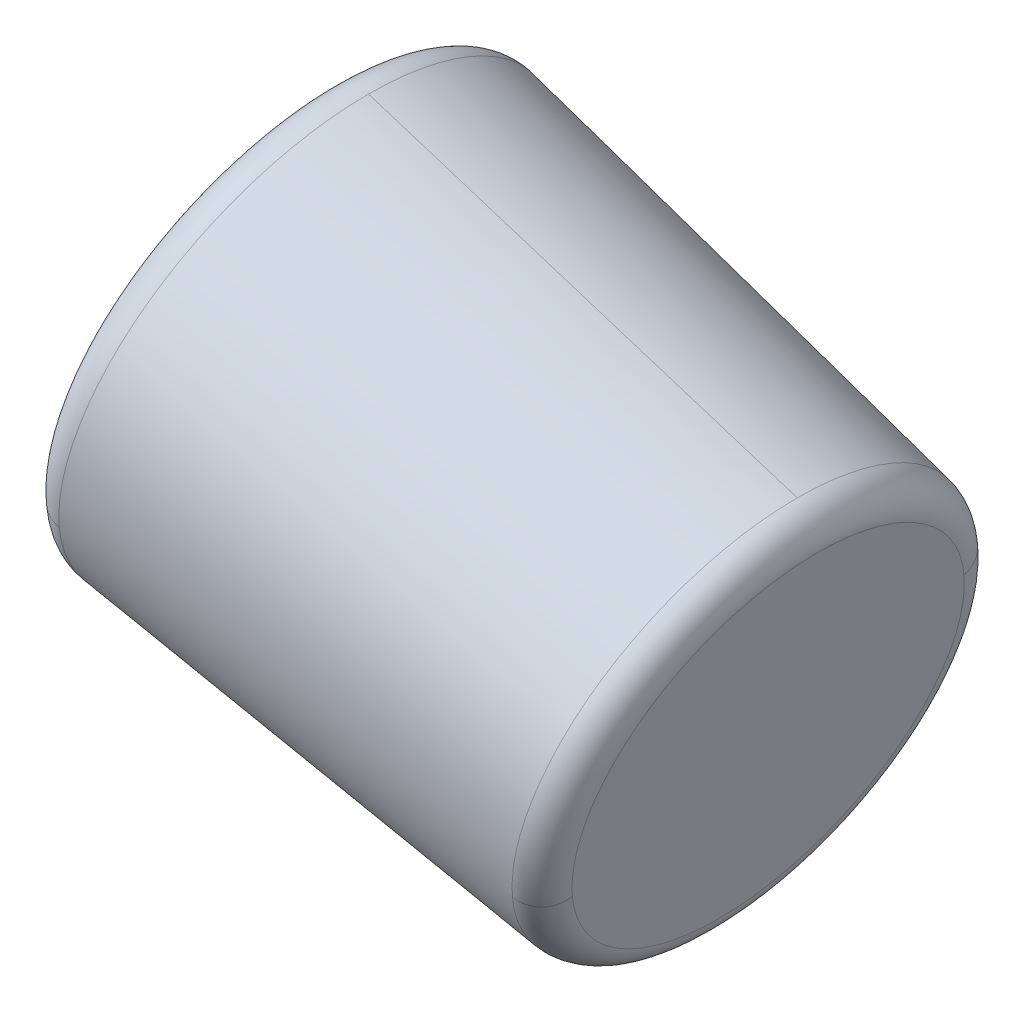
ISO-10303-21;
HEADER;
FILE_DESCRIPTION(('STEP AP214'),'2;1');
FILE_NAME('part.step','',(''),(''),'','','');
FILE_SCHEMA(('AUTOMOTIVE_DESIGN { 1 0 10303 214 1 1 1 1 }'));
ENDSEC;
DATA;
#1=APPLICATION_CONTEXT('core data for automotive mechanical design processes');
#2=APPLICATION_PROTOCOL_DEFINITION('international standard','automotive_design',2000,#1);
#3=PRODUCT_CONTEXT('',#1,'mechanical');
#4=PRODUCT('Part','Part','',(#3));
#5=PRODUCT_RELATED_PRODUCT_CATEGORY('part','',(#4));
#6=PRODUCT_DEFINITION_FORMATION('','',#4);
#7=PRODUCT_DEFINITION_CONTEXT('part definition',#1,'design');
#8=PRODUCT_DEFINITION('design','',#6,#7);
#9=PRODUCT_DEFINITION_SHAPE('','',#8);
#10=(LENGTH_UNIT() NAMED_UNIT(*) SI_UNIT(.MILLI.,.METRE.));
#11=(NAMED_UNIT(*) PLANE_ANGLE_UNIT() SI_UNIT($,.RADIAN.));
#12=(NAMED_UNIT(*) SI_UNIT($,.STERADIAN.) SOLID_ANGLE_UNIT());
#13=UNCERTAINTY_MEASURE_WITH_UNIT(LENGTH_MEASURE(1.E-05),#10,'distance_accuracy_value','');
#14=(GEOMETRIC_REPRESENTATION_CONTEXT(3) GLOBAL_UNCERTAINTY_ASSIGNED_CONTEXT((#13)) GLOBAL_UNIT_ASSIGNED_CONTEXT((#10,
#11,#12)) REPRESENTATION_CONTEXT('',''));
#15=CARTESIAN_POINT('',(0.,0.,0.));
#16=DIRECTION('',(0.,0.,1.));
#17=DIRECTION('',(1.,0.,0.));
#18=AXIS2_PLACEMENT_3D('',#15,#16,#17);
#19=CARTESIAN_POINT('',(6.32604460977271,43.985421211358,0.));
#20=DIRECTION('',(0.965431699015823,-0.260656161514401,0.));
#21=DIRECTION('',(0.260656161514401,0.965431699015823,0.));
#22=AXIS2_PLACEMENT_3D('',#19,#20,#21);
#23=PLANE('',#22);
#24=CARTESIAN_POINT('',(5.83229027874917,42.1566285216822,5.82997757341034));
#25=CARTESIAN_POINT('',(5.80742536509546,42.0645325754551,5.79898457091325));
#26=CARTESIAN_POINT('',(5.78275912235886,41.9731724767904,5.76564635816762));
#27=CARTESIAN_POINT('',(5.73388253565719,41.792140860782,5.69436856938648));
#28=CARTESIAN_POINT('',(5.70967219169213,41.7024693434384,5.65642899335098));
#29=CARTESIAN_POINT('',(5.66176595947083,41.5250317762689,5.57603753519732));
#30=CARTESIAN_POINT('',(5.63807007121459,41.437265726443,5.53358565307917));
#31=CARTESIAN_POINT('',(5.59124977369078,41.2638503000659,5.44427248074819));
#32=CARTESIAN_POINT('',(5.5681253644232,41.1782009235147,5.39741119053536));
#33=CARTESIAN_POINT('',(5.52250375026798,41.0092252422577,5.29939192677985));
#34=CARTESIAN_POINT('',(5.50000654538033,40.925898937552,5.24823395323718));
#35=CARTESIAN_POINT('',(5.455693533257,40.7617701238144,5.14174461192697));
#36=CARTESIAN_POINT('',(5.43387772602131,40.6809676147827,5.08641324415943));
#37=CARTESIAN_POINT('',(5.39098006658876,40.5220810571462,4.97171040043555));
#38=CARTESIAN_POINT('',(5.36989821439191,40.4439970085415,4.9123389244792));
#39=CARTESIAN_POINT('',(5.32851925274496,40.2907354818842,4.78969889869919));
#40=CARTESIAN_POINT('',(5.30822214329486,40.2155580038316,4.72643034887552));
#41=CARTESIAN_POINT('',(5.2684615647418,40.0682907277261,4.59614859397209));
#42=CARTESIAN_POINT('',(5.24899809563883,39.9962009296732,4.52913538889233));
#43=CARTESIAN_POINT('',(5.21095168695889,39.8552826841197,4.39152576438972));
#44=CARTESIAN_POINT('',(5.19236874738191,39.786454236619,4.32092934496687));
#45=CARTESIAN_POINT('',(5.15612816568922,39.6522245059516,4.17632336467373));
#46=CARTESIAN_POINT('',(5.13847052357351,39.5868232227847,4.10231380380344));
#47=CARTESIAN_POINT('',(5.10412307560818,39.4596053781983,3.95105983614673));
#48=CARTESIAN_POINT('',(5.08743326975857,39.3977888167788,3.8738154293603));
#49=CARTESIAN_POINT('',(5.05506170153003,39.2778893371996,3.7162778584086));
#50=CARTESIAN_POINT('',(5.0393799391511,39.21980641904,3.63598469424331));
#51=CARTESIAN_POINT('',(5.00906223660295,39.1075141528174,3.47254304180042));
#52=CARTESIAN_POINT('',(4.99442629643372,39.0533048047545,3.38939455352281));
#53=CARTESIAN_POINT('',(4.96623549756682,38.9488902737933,3.22044256484614));
#54=CARTESIAN_POINT('',(4.95268063886915,38.8986850908949,3.13463906444708));
#55=CARTESIAN_POINT('',(4.92668465778722,38.8023998389458,2.96058375967557));
#56=CARTESIAN_POINT('',(4.91424353540297,38.756319769895,2.87233195530311));
#57=CARTESIAN_POINT('',(4.89050499870141,38.6683957565635,2.69359264891146));
#58=CARTESIAN_POINT('',(4.87920758438411,38.6265518122828,2.60310514689227));
#59=CARTESIAN_POINT('',(4.85778368027709,38.5472008542182,2.42011243752527));
#60=CARTESIAN_POINT('',(4.84765719048737,38.5096938404344,2.32760723017747));
#61=CARTESIAN_POINT('',(4.82859953103639,38.4391071010452,2.14080196330027));
#62=CARTESIAN_POINT('',(4.81966836137513,38.4060273754397,2.04650190377086));
#63=CARTESIAN_POINT('',(4.80302285815107,38.3443749043636,1.85633410963357));
#64=CARTESIAN_POINT('',(4.79530852458826,38.3158021588929,1.76046637502568));
#65=CARTESIAN_POINT('',(4.78111527806635,38.2632324823328,1.5673941845011));
#66=CARTESIAN_POINT('',(4.77463636510724,38.2392355512434,1.47018972858441));
#67=CARTESIAN_POINT('',(4.76292956806154,38.1958753141549,1.27467826949064));
#68=CARTESIAN_POINT('',(4.75770168397494,38.1765120081556,1.17637126631357));
#69=CARTESIAN_POINT('',(4.74850953910492,38.1424656691476,0.97889154288036));
#70=CARTESIAN_POINT('',(4.7445452783215,38.1277826361387,0.879718822624227));
#71=CARTESIAN_POINT('',(4.73788993030929,38.1031322158239,0.680746580802505));
#72=CARTESIAN_POINT('',(4.73519884308051,38.093164828518,0.580947059236916));
#73=CARTESIAN_POINT('',(4.73109632524241,38.0779697119182,0.380961640585137));
#74=CARTESIAN_POINT('',(4.72968489463311,38.0727419826243,0.280775743498948));
#75=CARTESIAN_POINT('',(4.72814509029394,38.0670387761062,0.0802589304073007));
#76=CARTESIAN_POINT('',(4.72801671656407,38.0665632988821,-0.0200719855981579));
#77=CARTESIAN_POINT('',(4.72904333524735,38.0703657419699,-0.220637130563738));
#78=CARTESIAN_POINT('',(4.73019832766049,38.0746436622818,-0.320871359523859));
#79=CARTESIAN_POINT('',(4.73378889615189,38.087942594557,-0.521001657361718));
#80=CARTESIAN_POINT('',(4.73622447223015,38.0969636065202,-0.620897726239456));
#81=CARTESIAN_POINT('',(4.74237034053567,38.11972698969,-0.82011104553276));
#82=CARTESIAN_POINT('',(4.74608063276294,38.1334693608966,-0.919428295948325));
#83=CARTESIAN_POINT('',(4.75476699494753,38.1656423559772,-1.11724471436187));
#84=CARTESIAN_POINT('',(4.75974306490485,38.1840729798513,-1.21574388235985));
#85=CARTESIAN_POINT('',(4.77094899476116,38.2255780792795,-1.411686842815));
#86=CARTESIAN_POINT('',(4.77717885466016,38.2486525548337,-1.50913063527218));
#87=CARTESIAN_POINT('',(4.79087735612165,38.2993897691896,-1.70272809401463));
#88=CARTESIAN_POINT('',(4.79834599768415,38.3270525079913,-1.7988817602999));
#89=CARTESIAN_POINT('',(4.81450406986095,38.3868996068814,-1.9896673240944));
#90=CARTESIAN_POINT('',(4.82319350047525,38.4190839669698,-2.08429922160363));
#91=CARTESIAN_POINT('',(4.84177221715621,38.4878967734909,-2.27181327131617));
#92=CARTESIAN_POINT('',(4.85166150322287,38.5245252199237,-2.36469542351947));
#93=CARTESIAN_POINT('',(4.8726161066522,38.6021379579976,-2.54848622137998));
#94=CARTESIAN_POINT('',(4.88368142401487,38.6431222496389,-2.63939486703719));
#95=CARTESIAN_POINT('',(4.9069614327175,38.7293479433815,-2.81901964491547));
#96=CARTESIAN_POINT('',(4.91917612405746,38.774589345483,-2.90773577713654));
#97=CARTESIAN_POINT('',(4.94472545445334,38.8692202696457,-3.08276180320939));
#98=CARTESIAN_POINT('',(4.95806009350926,38.9186097917069,-3.16907169706118));
#99=CARTESIAN_POINT('',(4.98581719502361,39.0214179721047,-3.33907731830134));
#100=CARTESIAN_POINT('',(5.00023965748203,39.0748366304411,-3.42277304568971));
#101=CARTESIAN_POINT('',(5.03013766082606,39.1855743931623,-3.58734870366487));
#102=CARTESIAN_POINT('',(5.04561320171167,39.2428934975471,-3.66822863425166));
#103=CARTESIAN_POINT('',(5.07758007997657,39.361294065622,-3.82697785178664));
#104=CARTESIAN_POINT('',(5.09407141735587,39.4223755293121,-3.90484713873482));
#105=CARTESIAN_POINT('',(5.12803015953194,39.5481536654014,-4.05738747505978));
#106=CARTESIAN_POINT('',(5.14549756432871,39.6128503378007,-4.13205852443655));
#107=CARTESIAN_POINT('',(5.18136636083161,39.7457030313578,-4.27802249652033));
#108=CARTESIAN_POINT('',(5.19976775253774,39.8138590525156,-4.34931541922734));
#109=CARTESIAN_POINT('',(5.23746019229496,39.9534662497652,-4.48835138707625));
#110=CARTESIAN_POINT('',(5.25675124034605,40.024917425857,-4.55609443221816));
#111=CARTESIAN_POINT('',(5.29617651896874,40.1709428008327,-4.68786744600756));
#112=CARTESIAN_POINT('',(5.31631074954034,40.2455169997167,-4.75189741465504));
#113=CARTESIAN_POINT('',(5.35737388807906,40.3976087645,-4.87609002165273));
#114=CARTESIAN_POINT('',(5.37830279604617,40.4751263303992,-4.93625266000295));
#115=CARTESIAN_POINT('',(5.42090486980347,40.632918082607,-5.0525656693407));
#116=CARTESIAN_POINT('',(5.44257803559365,40.7131922689155,-5.10871604032824));
#117=CARTESIAN_POINT('',(5.48661641244235,40.8763038743957,-5.21686924377875));
#118=CARTESIAN_POINT('',(5.50898162350086,40.9591412935675,-5.26887207624171));
#119=CARTESIAN_POINT('',(5.55435021113382,41.1271798021757,-5.36860492326475));
#120=CARTESIAN_POINT('',(5.57735358770826,41.2123808916123,-5.41633493782483));
#121=CARTESIAN_POINT('',(5.62394308922406,41.3849414838629,-5.50740716325635));
#122=CARTESIAN_POINT('',(5.64752921416541,41.472300986677,-5.5507493741278));
#123=CARTESIAN_POINT('',(5.69522739137413,41.6489679489887,-5.63294157699979));
#124=CARTESIAN_POINT('',(5.7193394436415,41.7382754084863,-5.67179156900032));
#125=CARTESIAN_POINT('',(5.76803138745639,41.9186231346726,-5.74490574109678));
#126=CARTESIAN_POINT('',(5.7926112790039,42.0096634013614,-5.77916992119272));
#127=CARTESIAN_POINT('',(5.84217968626739,42.1932574179535,-5.84302992406928));
#128=CARTESIAN_POINT('',(5.86716820198338,42.2858111678568,-5.87262574684992));
#129=CARTESIAN_POINT('',(5.91749365806066,42.4722091807875,-5.92707773616528));
#130=CARTESIAN_POINT('',(5.94283059842194,42.5660534438149,-5.9519339027));
#131=CARTESIAN_POINT('',(5.99379186488155,42.7548064039454,-5.99684669884584));
#132=CARTESIAN_POINT('',(6.01941619097988,42.8497151010485,-6.01690332845695));
#133=CARTESIAN_POINT('',(6.07089049766635,43.0403682859618,-6.05216873256084));
#134=CARTESIAN_POINT('',(6.09674047825449,43.1361127737719,-6.06737750705363));
#135=CARTESIAN_POINT('',(6.14860381905773,43.3282068832585,-6.09291056171526));
#136=CARTESIAN_POINT('',(6.17461717927282,43.424556504935,-6.1032348418841));
#137=CARTESIAN_POINT('',(6.22674461084971,43.6176287674137,-6.11897403556278));
#138=CARTESIAN_POINT('',(6.25285868221151,43.714351408216,-6.12438894907261));
#139=CARTESIAN_POINT('',(6.30512462505993,43.9079366958671,-6.13029636532743));
#140=CARTESIAN_POINT('',(6.33127649654655,44.004799342716,-6.13078886807242));
#141=CARTESIAN_POINT('',(6.38355503725919,44.1984312909847,-6.12685027297474));
#142=CARTESIAN_POINT('',(6.4096817064852,44.2952005924045,-6.12241917513208));
#143=CARTESIAN_POINT('',(6.46184690212419,44.488412727359,-6.10864406622902));
#144=CARTESIAN_POINT('',(6.48788542853716,44.5848555608937,-6.09930005516863));
#145=CARTESIAN_POINT('',(6.53981160616702,44.777182408651,-6.07572158384336));
#146=CARTESIAN_POINT('',(6.56569925738391,44.8730664228736,-6.06148712357848));
#147=CARTESIAN_POINT('',(6.61726133128898,45.0640446845258,-6.02816221955008));
#148=CARTESIAN_POINT('',(6.64293575397718,45.1591389319555,-6.00907177578655));
#149=CARTESIAN_POINT('',(6.69400947303735,45.3483083998125,-5.96608024726276));
#150=CARTESIAN_POINT('',(6.71940876940934,45.4423836202398,-5.9421791625025));
#151=CARTESIAN_POINT('',(6.76987121783853,45.6292890324904,-5.8896263503446));
#152=CARTESIAN_POINT('',(6.79493436989575,45.7221192243136,-5.86097462294697));
#153=CARTESIAN_POINT('',(6.81979894079629,45.8142139010338,-5.82997757341034));
#154=B_SPLINE_CURVE_WITH_KNOTS('',3,(#24,#25,#26,#27,#28,#29,#30,#31,#32,#33,#34,#35,#36,#37,
#38,#39,#40,#41,#42,#43,#44,#45,#46,#47,#48,#49,#50,#51,#52,#53,#54,#55,#56,#57,#58,#59,#60,#61,
#62,#63,#64,#65,#66,#67,#68,#69,#70,#71,#72,#73,#74,#75,#76,#77,#78,#79,#80,#81,#82,#83,#84,#85,
#86,#87,#88,#89,#90,#91,#92,#93,#94,#95,#96,#97,#98,#99,#100,#101,#102,#103,#104,#105,#106,#107,
#108,#109,#110,#111,#112,#113,#114,#115,#116,#117,#118,#119,#120,#121,#122,#123,#124,#125,#126,
#127,#128,#129,#130,#131,#132,#133,#134,#135,#136,#137,#138,#139,#140,#141,#142,#143,#144,#145,
#146,#147,#148,#149,#150,#151,#152,#153),.UNSPECIFIED.,.F.,.F.,(4,2,2,2,2,2,2,2,2,2,2,2,2,2,2,2,
2,2,2,2,2,2,2,2,2,2,2,2,2,2,2,2,2,2,2,2,2,2,2,2,2,2,2,2,2,2,2,2,2,2,2,2,2,2,2,2,2,2,2,2,2,2,2,2,
4),(0.,0.300875519932012,0.601751039864023,0.90262655979604,1.20350207972805,1.50437759966006,
1.80525311959208,2.10612863952409,2.4070041594561,2.70787967938812,3.00875519932013,
3.30963071925214,3.61050623918416,3.91138175911617,4.21225727904818,4.5131327989802,
4.81400831891221,5.11488383884422,5.41575935877623,5.71663487870825,6.01751039864026,
6.31838591857227,6.61926143850429,6.9201369584363,7.22101247836831,7.52188799830033,
7.82276351823234,8.12363903816435,8.42451455809637,8.72539007802838,9.02626559796039,
9.3271411178924,9.62801663782442,9.92889215775643,10.2297676776884,10.5306431976205,
10.8315187175525,11.1323942374845,11.4332697574165,11.7341452773485,12.0350207972805,
12.3358963172125,12.6367718371446,12.9376473570766,13.2385228770086,13.5393983969406,
13.8402739168726,14.1411494368046,14.4420249567366,14.7429004766686,15.0437759966007,
15.3446515165327,15.6455270364647,15.9464025563967,16.2472780763287,16.5481535962607,
16.8490291161927,17.1499046361248,17.4507801560568,17.7516556759888,18.0525311959208,
18.3534067158528,18.6542822357848,18.9551577557168,19.2560332756488),.UNSPECIFIED.);
#155=CARTESIAN_POINT('',(5.83229027874917,42.1566285216822,5.82997757341034));
#156=VERTEX_POINT('',#155);
#157=CARTESIAN_POINT('',(6.81979894079629,45.8142139010338,-5.82997757341034));
#158=VERTEX_POINT('',#157);
#159=EDGE_CURVE('E11',#156,#158,#154,.T.);
#160=ORIENTED_EDGE('',*,*,#159,.F.);
#161=CARTESIAN_POINT('',(6.81979894079629,45.8142139010338,-5.82997757341034));
#162=CARTESIAN_POINT('',(6.84466385445,45.9063098472609,-5.79898457091325));
#163=CARTESIAN_POINT('',(6.8693300971866,45.9976699459256,-5.76564635816762));
#164=CARTESIAN_POINT('',(6.91820668388826,46.178701561934,-5.69436856938648));
#165=CARTESIAN_POINT('',(6.94241702785333,46.2683730792776,-5.65642899335098));
#166=CARTESIAN_POINT('',(6.99032326007463,46.4458106464471,-5.57603753519732));
#167=CARTESIAN_POINT('',(7.01401914833087,46.533576696273,-5.53358565307917));
#168=CARTESIAN_POINT('',(7.06083944585468,46.7069921226501,-5.44427248074819));
#169=CARTESIAN_POINT('',(7.08396385512226,46.7926414992013,-5.39741119053536));
#170=CARTESIAN_POINT('',(7.12958546927748,46.9616171804583,-5.29939192677985));
#171=CARTESIAN_POINT('',(7.15208267416512,47.044943485164,-5.24823395323718));
#172=CARTESIAN_POINT('',(7.19639568628846,47.2090722989016,-5.14174461192697));
#173=CARTESIAN_POINT('',(7.21821149352415,47.2898748079333,-5.08641324415943));
#174=CARTESIAN_POINT('',(7.26110915295669,47.4487613655698,-4.97171040043555));
#175=CARTESIAN_POINT('',(7.28219100515355,47.5268454141745,-4.9123389244792));
#176=CARTESIAN_POINT('',(7.3235699668005,47.6801069408318,-4.78969889869919));
#177=CARTESIAN_POINT('',(7.3438670762506,47.7552844188844,-4.72643034887553));
#178=CARTESIAN_POINT('',(7.38362765480366,47.9025516949899,-4.5961485939721));
#179=CARTESIAN_POINT('',(7.40309112390663,47.9746414930428,-4.52913538889234));
#180=CARTESIAN_POINT('',(7.44113753258657,48.1155597385963,-4.39152576438972));
#181=CARTESIAN_POINT('',(7.45972047216355,48.184388186097,-4.32092934496687));
#182=CARTESIAN_POINT('',(7.49596105385624,48.3186179167645,-4.17632336467373));
#183=CARTESIAN_POINT('',(7.51361869597195,48.3840191999313,-4.10231380380345));
#184=CARTESIAN_POINT('',(7.54796614393728,48.5112370445177,-3.95105983614674));
#185=CARTESIAN_POINT('',(7.56465594978689,48.5730536059372,-3.87381542936031));
#186=CARTESIAN_POINT('',(7.59702751801543,48.6929530855164,-3.7162778584086));
#187=CARTESIAN_POINT('',(7.61270928039436,48.751036003676,-3.63598469424332));
#188=CARTESIAN_POINT('',(7.64302698294251,48.8633282698986,-3.47254304180042));
#189=CARTESIAN_POINT('',(7.65766292311174,48.9175376179615,-3.38939455352281));
#190=CARTESIAN_POINT('',(7.68585372197864,49.0219521489227,-3.22044256484614));
#191=CARTESIAN_POINT('',(7.69940858067631,49.0721573318211,-3.13463906444708));
#192=CARTESIAN_POINT('',(7.72540456175823,49.1684425837702,-2.96058375967557));
#193=CARTESIAN_POINT('',(7.73784568414249,49.214522652821,-2.87233195530312));
#194=CARTESIAN_POINT('',(7.76158422084405,49.3024466661525,-2.69359264891147));
#195=CARTESIAN_POINT('',(7.77288163516135,49.3442906104332,-2.60310514689227));
#196=CARTESIAN_POINT('',(7.79430553926837,49.4236415684978,-2.42011243752528));
#197=CARTESIAN_POINT('',(7.80443202905809,49.4611485822816,-2.32760723017748));
#198=CARTESIAN_POINT('',(7.82348968850907,49.5317353216709,-2.14080196330027));
#199=CARTESIAN_POINT('',(7.83242085817033,49.5648150472763,-2.04650190377087));
#200=CARTESIAN_POINT('',(7.84906636139439,49.6264675183524,-1.85633410963357));
#201=CARTESIAN_POINT('',(7.8567806949572,49.6550402638231,-1.76046637502568));
#202=CARTESIAN_POINT('',(7.87097394147911,49.7076099403832,-1.5673941845011));
#203=CARTESIAN_POINT('',(7.87745285443821,49.7316068714726,-1.47018972858441));
#204=CARTESIAN_POINT('',(7.88915965148392,49.7749671085612,-1.27467826949065));
#205=CARTESIAN_POINT('',(7.89438753557052,49.7943304145604,-1.17637126631358));
#206=CARTESIAN_POINT('',(7.90357968044054,49.8283767535684,-0.978891542880368));
#207=CARTESIAN_POINT('',(7.90754394122396,49.8430597865773,-0.879718822624233));
#208=CARTESIAN_POINT('',(7.91419928923617,49.8677102068921,-0.68074658080251));
#209=CARTESIAN_POINT('',(7.91689037646495,49.877677594198,-0.580947059236922));
#210=CARTESIAN_POINT('',(7.92099289430305,49.8928727107978,-0.380961640585146));
#211=CARTESIAN_POINT('',(7.92240432491235,49.8981004400917,-0.280775743498958));
#212=CARTESIAN_POINT('',(7.92394412925152,49.9038036466098,-0.0802589304073099));
#213=CARTESIAN_POINT('',(7.92407250298138,49.9042791238339,0.0200719855981495));
#214=CARTESIAN_POINT('',(7.92304588429811,49.9004766807461,0.22063713056373));
#215=CARTESIAN_POINT('',(7.92189089188496,49.8961987604342,0.320871359523851));
#216=CARTESIAN_POINT('',(7.91830032339357,49.882899828159,0.52100165736171));
#217=CARTESIAN_POINT('',(7.91586474731531,49.8738788161958,0.620897726239447));
#218=CARTESIAN_POINT('',(7.90971887900979,49.851115433026,0.82011104553275));
#219=CARTESIAN_POINT('',(7.90600858678252,49.8373730618194,0.919428295948315));
#220=CARTESIAN_POINT('',(7.89732222459793,49.8052000667388,1.11724471436186));
#221=CARTESIAN_POINT('',(7.89234615464061,49.7867694428648,1.21574388235984));
#222=CARTESIAN_POINT('',(7.8811402247843,49.7452643434365,1.41168684281499));
#223=CARTESIAN_POINT('',(7.8749103648853,49.7221898678823,1.50913063527217));
#224=CARTESIAN_POINT('',(7.86121186342381,49.6714526535264,1.70272809401462));
#225=CARTESIAN_POINT('',(7.85374322186131,49.6437899147248,1.79888176029989));
#226=CARTESIAN_POINT('',(7.83758514968451,49.5839428158346,1.9896673240944));
#227=CARTESIAN_POINT('',(7.8288957190702,49.5517584557462,2.08429922160362));
#228=CARTESIAN_POINT('',(7.81031700238924,49.4829456492251,2.27181327131616));
#229=CARTESIAN_POINT('',(7.80042771632259,49.4463172027924,2.36469542351946));
#230=CARTESIAN_POINT('',(7.77947311289326,49.3687044647184,2.54848622137998));
#231=CARTESIAN_POINT('',(7.76840779553059,49.3277201730772,2.63939486703718));
#232=CARTESIAN_POINT('',(7.74512778682796,49.2414944793345,2.81901964491546));
#233=CARTESIAN_POINT('',(7.732913095488,49.196253077233,2.90773577713653));
#234=CARTESIAN_POINT('',(7.70736376509212,49.1016221530703,3.08276180320938));
#235=CARTESIAN_POINT('',(7.6940291260362,49.0522326310091,3.16907169706117));
#236=CARTESIAN_POINT('',(7.66627202452185,48.9494244506114,3.33907731830133));
#237=CARTESIAN_POINT('',(7.65184956206343,48.8960057922749,3.4227730456897));
#238=CARTESIAN_POINT('',(7.6219515587194,48.7852680295537,3.58734870366486));
#239=CARTESIAN_POINT('',(7.60647601783379,48.7279489251689,3.66822863425166));
#240=CARTESIAN_POINT('',(7.57450913956889,48.609548357094,3.82697785178663));
#241=CARTESIAN_POINT('',(7.55801780218959,48.5484668934039,3.90484713873481));
#242=CARTESIAN_POINT('',(7.52405906001352,48.4226887573146,4.05738747505977));
#243=CARTESIAN_POINT('',(7.50659165521675,48.3579920849153,4.13205852443655));
#244=CARTESIAN_POINT('',(7.47072285871385,48.2251393913582,4.27802249652032));
#245=CARTESIAN_POINT('',(7.45232146700772,48.1569833702004,4.34931541922733));
#246=CARTESIAN_POINT('',(7.4146290272505,48.0173761729508,4.48835138707624));
#247=CARTESIAN_POINT('',(7.39533797919941,47.9459249968591,4.55609443221816));
#248=CARTESIAN_POINT('',(7.35591270057672,47.7998996218833,4.68786744600755));
#249=CARTESIAN_POINT('',(7.33577847000512,47.7253254229993,4.75189741465503));
#250=CARTESIAN_POINT('',(7.2947153314664,47.573233658216,4.87609002165272));
#251=CARTESIAN_POINT('',(7.27378642349929,47.4957160923168,4.93625266000294));
#252=CARTESIAN_POINT('',(7.23118434974199,47.337924340109,5.05256566934069));
#253=CARTESIAN_POINT('',(7.20951118395181,47.2576501538005,5.10871604032824));
#254=CARTESIAN_POINT('',(7.16547280710311,47.0945385483203,5.21686924377874));
#255=CARTESIAN_POINT('',(7.1431075960446,47.0117011291485,5.2688720762417));
#256=CARTESIAN_POINT('',(7.09773900841164,46.8436626205403,5.36860492326474));
#257=CARTESIAN_POINT('',(7.0747356318372,46.7584615311037,5.41633493782482));
#258=CARTESIAN_POINT('',(7.0281461303214,46.5859009388532,5.50740716325635));
#259=CARTESIAN_POINT('',(7.00456000538005,46.4985414360391,5.5507493741278));
#260=CARTESIAN_POINT('',(6.95686182817133,46.3218744737274,5.63294157699978));
#261=CARTESIAN_POINT('',(6.93274977590396,46.2325670142298,5.67179156900031));
#262=CARTESIAN_POINT('',(6.88405783208908,46.0522192880434,5.74490574109678));
#263=CARTESIAN_POINT('',(6.85947794054157,45.9611790213547,5.77916992119271));
#264=CARTESIAN_POINT('',(6.80990953327807,45.7775850047626,5.84302992406928));
#265=CARTESIAN_POINT('',(6.78492101756208,45.6850312548592,5.87262574684991));
#266=CARTESIAN_POINT('',(6.7345955614848,45.4986332419285,5.92707773616527));
#267=CARTESIAN_POINT('',(6.70925862112352,45.4047889789012,5.9519339027));
#268=CARTESIAN_POINT('',(6.65829735466391,45.2160360187707,5.99684669884584));
#269=CARTESIAN_POINT('',(6.63267302856559,45.1211273216675,6.01690332845695));
#270=CARTESIAN_POINT('',(6.58119872187912,44.9304741367543,6.05216873256084));
#271=CARTESIAN_POINT('',(6.55534874129097,44.8347296489442,6.06737750705363));
#272=CARTESIAN_POINT('',(6.50348540048773,44.6426355394576,6.09291056171526));
#273=CARTESIAN_POINT('',(6.47747204027264,44.546285917781,6.1032348418841));
#274=CARTESIAN_POINT('',(6.42534460869575,44.3532136553023,6.11897403556278));
#275=CARTESIAN_POINT('',(6.39923053733395,44.2564910145001,6.12438894907261));
#276=CARTESIAN_POINT('',(6.34696459448553,44.0629057268489,6.13029636532743));
#277=CARTESIAN_POINT('',(6.32081272299891,43.96604308,6.13078886807242));
#278=CARTESIAN_POINT('',(6.26853418228628,43.7724111317313,6.12685027297474));
#279=CARTESIAN_POINT('',(6.24240751306026,43.6756418303116,6.12241917513208));
#280=CARTESIAN_POINT('',(6.19024231742127,43.4824296953571,6.10864406622903));
#281=CARTESIAN_POINT('',(6.1642037910083,43.3859868618223,6.09930005516864));
#282=CARTESIAN_POINT('',(6.11227761337844,43.193660014065,6.07572158384337));
#283=CARTESIAN_POINT('',(6.08638996216156,43.0977759998424,6.06148712357849));
#284=CARTESIAN_POINT('',(6.03482788825648,42.9067977381902,6.02816221955008));
#285=CARTESIAN_POINT('',(6.00915346556829,42.8117034907606,6.00907177578655));
#286=CARTESIAN_POINT('',(5.95807974650811,42.6225340229036,5.96608024726276));
#287=CARTESIAN_POINT('',(5.93268045013612,42.5284588024762,5.9421791625025));
#288=CARTESIAN_POINT('',(5.88221800170693,42.3415533902257,5.88962635034461));
#289=CARTESIAN_POINT('',(5.85715484964972,42.2487231984025,5.86097462294697));
#290=CARTESIAN_POINT('',(5.83229027874918,42.1566285216822,5.82997757341034));
#291=B_SPLINE_CURVE_WITH_KNOTS('',3,(#161,#162,#163,#164,#165,#166,#167,#168,#169,#170,#171,
#172,#173,#174,#175,#176,#177,#178,#179,#180,#181,#182,#183,#184,#185,#186,#187,#188,#189,#190,
#191,#192,#193,#194,#195,#196,#197,#198,#199,#200,#201,#202,#203,#204,#205,#206,#207,#208,#209,
#210,#211,#212,#213,#214,#215,#216,#217,#218,#219,#220,#221,#222,#223,#224,#225,#226,#227,#228,
#229,#230,#231,#232,#233,#234,#235,#236,#237,#238,#239,#240,#241,#242,#243,#244,#245,#246,#247,
#248,#249,#250,#251,#252,#253,#254,#255,#256,#257,#258,#259,#260,#261,#262,#263,#264,#265,#266,
#267,#268,#269,#270,#271,#272,#273,#274,#275,#276,#277,#278,#279,#280,#281,#282,#283,#284,#285,
#286,#287,#288,#289,#290),.UNSPECIFIED.,.F.,.F.,(4,2,2,2,2,2,2,2,2,2,2,2,2,2,2,2,2,2,2,2,2,2,2,
2,2,2,2,2,2,2,2,2,2,2,2,2,2,2,2,2,2,2,2,2,2,2,2,2,2,2,2,2,2,2,2,2,2,2,2,2,2,2,2,2,4),(0.,
0.300875519932013,0.601751039864029,0.90262655979604,1.20350207972805,1.50437759966007,
1.80525311959208,2.10612863952409,2.4070041594561,2.70787967938812,3.00875519932013,
3.30963071925214,3.61050623918415,3.91138175911617,4.21225727904818,4.51313279898019,
4.81400831891221,5.11488383884422,5.41575935877623,5.71663487870824,6.01751039864026,
6.31838591857227,6.61926143850428,6.9201369584363,7.22101247836831,7.52188799830032,
7.82276351823234,8.12363903816435,8.42451455809636,8.72539007802837,9.02626559796039,
9.3271411178924,9.62801663782441,9.92889215775642,10.2297676776884,10.5306431976205,
10.8315187175525,11.1323942374845,11.4332697574165,11.7341452773485,12.0350207972805,
12.3358963172125,12.6367718371445,12.9376473570766,13.2385228770086,13.5393983969406,
13.8402739168726,14.1411494368046,14.4420249567366,14.7429004766686,15.0437759966006,
15.3446515165327,15.6455270364647,15.9464025563967,16.2472780763287,16.5481535962607,
16.8490291161927,17.1499046361247,17.4507801560567,17.7516556759888,18.0525311959208,
18.3534067158528,18.6542822357848,18.9551577557168,19.2560332756488),.UNSPECIFIED.);
#292=EDGE_CURVE('E26',#158,#156,#291,.T.);
#293=ORIENTED_EDGE('',*,*,#292,.F.);
#294=EDGE_LOOP('',(#160,#293));
#295=FACE_BOUND('',#294,.T.);
#296=ADVANCED_FACE('F17',(#295),#23,.F.);
#297=CARTESIAN_POINT('',(7.19557676001964,43.7506568952207,0.));
#298=DIRECTION('',(0.965431699015823,-0.260656161514401,0.));
#299=DIRECTION('',(-0.247898740920753,-0.9181801083869,-0.309016994374947));
#300=AXIS2_PLACEMENT_3D('',#297,#298,#299);
#301=TOROIDAL_SURFACE('',#300,6.13000118659725,0.900666666666658);
#302=CARTESIAN_POINT('',(7.6893310910432,45.5794495848965,-5.82997757341034));
#303=DIRECTION('',(0.247898740920753,0.918180108386901,0.309016994374945));
#304=DIRECTION('',(0.120884808757361,0.287163587616582,-0.950223098518906));
#305=AXIS2_PLACEMENT_3D('',#302,#303,#304);
#306=CIRCLE('',#305,0.900666666666657);
#307=CARTESIAN_POINT('',(7.79820800879732,45.8380882561432,-6.68581184414303));
#308=VERTEX_POINT('',#307);
#309=EDGE_CURVE('E143',#308,#158,#306,.T.);
#310=ORIENTED_EDGE('',*,*,#309,.T.);
#311=ORIENTED_EDGE('',*,*,#292,.T.);
#312=CARTESIAN_POINT('',(6.70182242899608,41.9218642055449,5.82997757341034));
#313=DIRECTION('',(-0.247898740920753,-0.918180108386899,-0.309016994374949));
#314=DIRECTION('',(-0.0400683902642538,-0.308983150257038,0.950223098518905));
#315=AXIS2_PLACEMENT_3D('',#312,#313,#314);
#316=CIRCLE('',#315,0.900666666666658);
#317=CARTESIAN_POINT('',(6.66573416549808,41.6435733815467,6.68581184414303));
#318=VERTEX_POINT('',#317);
#319=EDGE_CURVE('E145',#318,#156,#316,.T.);
#320=ORIENTED_EDGE('',*,*,#319,.F.);
#321=CARTESIAN_POINT('',(7.2319710871477,43.7408308188449,0.));
#322=DIRECTION('',(0.965431699015823,-0.260656161514401,0.));
#323=DIRECTION('',(0.260656161514401,0.965431699015823,0.));
#324=AXIS2_PLACEMENT_3D('',#321,#322,#323);
#325=CIRCLE('',#324,7.02987859248117);
#326=CARTESIAN_POINT('',(9.0643522569761,50.527698452259,0.));
#327=VERTEX_POINT('',#326);
#328=EDGE_CURVE('E163',#327,#318,#325,.T.);
#329=ORIENTED_EDGE('',*,*,#328,.F.);
#330=CARTESIAN_POINT('',(7.2319710871477,43.7408308188449,0.));
#331=DIRECTION('',(0.965431699015823,-0.260656161514401,0.));
#332=DIRECTION('',(0.260656161514401,0.965431699015823,0.));
#333=AXIS2_PLACEMENT_3D('',#330,#331,#332);
#334=CIRCLE('',#333,7.02987859248117);
#335=EDGE_CURVE('E166',#308,#327,#334,.T.);
#336=ORIENTED_EDGE('',*,*,#335,.F.);
#337=EDGE_LOOP('',(#310,#311,#320,#329,#336));
#338=FACE_BOUND('',#337,.T.);
#339=ADVANCED_FACE('F125',(#338),#301,.T.);
#340=CARTESIAN_POINT('',(7.2319710871477,43.7408308188449,0.));
#341=DIRECTION('',(-0.965431699015823,0.260656161514401,0.));
#342=DIRECTION('',(0.,0.,1.));
#343=AXIS2_PLACEMENT_3D('',#340,#341,#342);
#344=CONICAL_SURFACE('',#343,7.02987859248117,0.0418672980832882);
#345=DIRECTION('',(-0.953675902841685,0.300835955861491,0.));
#346=VECTOR('',#345,1.);
#347=CARTESIAN_POINT('',(21.662642580504,46.553582402555,0.));
#348=LINE('',#347,#346);
#349=CARTESIAN_POINT('',(21.662642580504,46.553582402555,0.));
#350=VERTEX_POINT('',#349);
#351=EDGE_CURVE('E175',#350,#327,#348,.T.);
#352=ORIENTED_EDGE('',*,*,#351,.F.);
#353=CARTESIAN_POINT('',(19.9743822718913,40.3005170284035,0.));
#354=DIRECTION('',(0.965431699015823,-0.260656161514401,0.));
#355=DIRECTION('',(0.260656161514401,0.965431699015823,0.));
#356=AXIS2_PLACEMENT_3D('',#353,#354,#355);
#357=CIRCLE('',#356,6.47696297990419);
#358=CARTESIAN_POINT('',(20.4960833981813,42.2328204959539,-6.15995784784036));
#359=VERTEX_POINT('',#358);
#360=EDGE_CURVE('E180',#359,#350,#357,.T.);
#361=ORIENTED_EDGE('',*,*,#360,.F.);
#362=CARTESIAN_POINT('',(19.9743822718913,40.3005170284035,0.));
#363=DIRECTION('',(0.965431699015823,-0.260656161514401,0.));
#364=DIRECTION('',(0.260656161514401,0.965431699015823,0.));
#365=AXIS2_PLACEMENT_3D('',#362,#363,#364);
#366=CIRCLE('',#365,6.47696297990419);
#367=CARTESIAN_POINT('',(18.2861219632786,34.047451654252,0.));
#368=VERTEX_POINT('',#367);
#369=EDGE_CURVE('E89',#368,#359,#366,.T.);
#370=ORIENTED_EDGE('',*,*,#369,.F.);
#371=DIRECTION('',(-0.975495465482104,0.220019537368509,0.));
#372=VECTOR('',#371,1.);
#373=CARTESIAN_POINT('',(18.2861219632786,34.047451654252,0.));
#374=LINE('',#373,#372);
#375=CARTESIAN_POINT('',(5.3995899173193,36.9539631854309,0.));
#376=VERTEX_POINT('',#375);
#377=EDGE_CURVE('E187',#368,#376,#374,.T.);
#378=ORIENTED_EDGE('',*,*,#377,.T.);
#379=CARTESIAN_POINT('',(7.2319710871477,43.7408308188449,0.));
#380=DIRECTION('',(0.965431699015823,-0.260656161514401,0.));
#381=DIRECTION('',(0.260656161514401,0.965431699015823,0.));
#382=AXIS2_PLACEMENT_3D('',#379,#380,#381);
#383=CIRCLE('',#382,7.02987859248117);
#384=EDGE_CURVE('E191',#376,#308,#383,.T.);
#385=ORIENTED_EDGE('',*,*,#384,.T.);
#386=ORIENTED_EDGE('',*,*,#335,.T.);
#387=EDGE_LOOP('',(#352,#361,#370,#378,#385,#386));
#388=FACE_BOUND('',#387,.T.);
#389=ADVANCED_FACE('F121',(#388),#344,.T.);
#390=CARTESIAN_POINT('',(7.19557676001964,43.7506568952207,0.));
#391=DIRECTION('',(0.965431699015823,-0.260656161514401,0.));
#392=DIRECTION('',(0.247898740920753,0.9181801083869,0.309016994374947));
#393=AXIS2_PLACEMENT_3D('',#390,#391,#392);
#394=TOROIDAL_SURFACE('',#393,6.13000118659725,0.900666666666658);
#395=ORIENTED_EDGE('',*,*,#309,.F.);
#396=ORIENTED_EDGE('',*,*,#384,.F.);
#397=CARTESIAN_POINT('',(7.2319710871477,43.7408308188449,0.));
#398=DIRECTION('',(0.965431699015823,-0.260656161514401,0.));
#399=DIRECTION('',(0.260656161514401,0.965431699015823,0.));
#400=AXIS2_PLACEMENT_3D('',#397,#398,#399);
#401=CIRCLE('',#400,7.02987859248117);
#402=EDGE_CURVE('E102',#318,#376,#401,.T.);
#403=ORIENTED_EDGE('',*,*,#402,.F.);
#404=ORIENTED_EDGE('',*,*,#319,.T.);
#405=ORIENTED_EDGE('',*,*,#159,.T.);
#406=EDGE_LOOP('',(#395,#396,#403,#404,#405));
#407=FACE_BOUND('',#406,.T.);
#408=ADVANCED_FACE('F110',(#407),#394,.T.);
#409=CARTESIAN_POINT('',(7.2319710871477,43.7408308188449,0.));
#410=DIRECTION('',(-0.965431699015823,0.260656161514401,0.));
#411=DIRECTION('',(0.,0.,-1.));
#412=AXIS2_PLACEMENT_3D('',#409,#410,#411);
#413=CONICAL_SURFACE('',#412,7.02987859248117,0.0418672980832882);
#414=ORIENTED_EDGE('',*,*,#351,.T.);
#415=ORIENTED_EDGE('',*,*,#328,.T.);
#416=ORIENTED_EDGE('',*,*,#402,.T.);
#417=ORIENTED_EDGE('',*,*,#377,.F.);
#418=CARTESIAN_POINT('',(19.9743822718913,40.3005170284035,0.));
#419=DIRECTION('',(0.965431699015823,-0.260656161514401,0.));
#420=DIRECTION('',(0.260656161514401,0.965431699015823,0.));
#421=AXIS2_PLACEMENT_3D('',#418,#419,#420);
#422=CIRCLE('',#421,6.47696297990419);
#423=CARTESIAN_POINT('',(19.4526811456013,38.3682135608532,6.15995784784036));
#424=VERTEX_POINT('',#423);
#425=EDGE_CURVE('E92',#424,#368,#422,.T.);
#426=ORIENTED_EDGE('',*,*,#425,.F.);
#427=CARTESIAN_POINT('',(19.9743822718913,40.3005170284035,0.));
#428=DIRECTION('',(0.965431699015823,-0.260656161514401,0.));
#429=DIRECTION('',(0.260656161514401,0.965431699015823,0.));
#430=AXIS2_PLACEMENT_3D('',#427,#428,#429);
#431=CIRCLE('',#430,6.47696297990419);
#432=EDGE_CURVE('E90',#350,#424,#431,.T.);
#433=ORIENTED_EDGE('',*,*,#432,.F.);
#434=EDGE_LOOP('',(#414,#415,#416,#417,#426,#433));
#435=FACE_BOUND('',#434,.T.);
#436=ADVANCED_FACE('F120',(#435),#413,.T.);
#437=CARTESIAN_POINT('',(19.9379879447623,40.3103431047795,0.));
#438=DIRECTION('',(0.965431699015823,-0.260656161514401,0.));
#439=DIRECTION('',(-0.247898740920753,-0.9181801083869,-0.309016994374947));
#440=AXIS2_PLACEMENT_3D('',#437,#438,#439);
#441=TOROIDAL_SURFACE('',#440,5.57708557401899,0.900666666667968);
#442=CARTESIAN_POINT('',(20.3872064804262,41.9741818247071,-5.30412357710646));
#443=DIRECTION('',(0.247898740920754,0.9181801083869,0.309016994374947));
#444=DIRECTION('',(0.965431699015823,-0.260656161514401,0.));
#445=AXIS2_PLACEMENT_3D('',#442,#443,#444);
#446=CIRCLE('',#445,0.900666666667966);
#447=CARTESIAN_POINT('',(21.2567386306744,41.7394175085694,-5.30412357710646));
#448=VERTEX_POINT('',#447);
#449=EDGE_CURVE('E73',#448,#359,#446,.T.);
#450=ORIENTED_EDGE('',*,*,#449,.T.);
#451=ORIENTED_EDGE('',*,*,#360,.T.);
#452=ORIENTED_EDGE('',*,*,#432,.T.);
#453=CARTESIAN_POINT('',(19.4887694090985,38.646504384852,5.30412357710646));
#454=DIRECTION('',(-0.247898740920752,-0.9181801083869,-0.309016994374947));
#455=DIRECTION('',(0.965431699015823,-0.2606561615144,0.));
#456=AXIS2_PLACEMENT_3D('',#453,#454,#455);
#457=CIRCLE('',#456,0.90066666666797);
#458=CARTESIAN_POINT('',(20.3583015593467,38.4117400687143,5.30412357710646));
#459=VERTEX_POINT('',#458);
#460=EDGE_CURVE('E77',#459,#424,#457,.T.);
#461=ORIENTED_EDGE('',*,*,#460,.F.);
#462=CARTESIAN_POINT('',(21.2567386306742,41.7394175085699,-5.30412357710779));
#463=CARTESIAN_POINT('',(21.6908871612944,43.3474391686244,-4.76218954473174));
#464=CARTESIAN_POINT('',(22.0708051066546,44.7545987974041,-3.56909792784469));
#465=CARTESIAN_POINT('',(22.3022389066199,45.6117952105335,-1.82206842503276));
#466=CARTESIAN_POINT('',(22.3602186255275,45.8265434758657,1.93550895534485));
#467=CARTESIAN_POINT('',(21.7376141895939,43.520509139651,4.84470740016568));
#468=CARTESIAN_POINT('',(21.2827181883705,41.8356419307385,5.73619575934152));
#469=CARTESIAN_POINT('',(20.7925647292416,40.0201863356127,5.84470401243973));
#470=CARTESIAN_POINT('',(20.3583015593463,38.411740068714,5.3041235771078));
#471=B_SPLINE_CURVE_WITH_KNOTS('',5,(#462,#463,#464,#465,#466,#467,#468,#469,#470),
.UNSPECIFIED.,.F.,.F.,(6,3,6),(0.,1.57079632679489,3.14159265358979),.UNSPECIFIED.);
#472=EDGE_CURVE('E67',#448,#459,#471,.T.);
#473=ORIENTED_EDGE('',*,*,#472,.F.);
#474=EDGE_LOOP('',(#450,#451,#452,#461,#473));
#475=FACE_BOUND('',#474,.T.);
#476=ADVANCED_FACE('F70',(#475),#441,.T.);
#477=CARTESIAN_POINT('',(22.2612218131718,45.4598739899251,0.));
#478=DIRECTION('',(-0.965431699015823,0.260656161514401,0.));
#479=DIRECTION('',(-0.260656161514401,-0.965431699015823,0.));
#480=AXIS2_PLACEMENT_3D('',#477,#478,#479);
#481=PLANE('',#480);
#482=ORIENTED_EDGE('',*,*,#472,.T.);
#483=CARTESIAN_POINT('',(20.8075200950105,40.0755787886418,0.));
#484=DIRECTION('',(0.965431699015823,-0.260656161514401,0.));
#485=DIRECTION('',(0.260656161514401,0.965431699015823,0.));
#486=AXIS2_PLACEMENT_3D('',#483,#484,#485);
#487=CIRCLE('',#486,5.57708557402039);
#488=EDGE_CURVE('E81',#459,#448,#487,.T.);
#489=ORIENTED_EDGE('',*,*,#488,.T.);
#490=EDGE_LOOP('',(#482,#489));
#491=FACE_BOUND('',#490,.T.);
#492=ADVANCED_FACE('F84',(#491),#481,.F.);
#493=CARTESIAN_POINT('',(19.9379879447623,40.3103431047795,0.));
#494=DIRECTION('',(0.965431699015823,-0.260656161514401,0.));
#495=DIRECTION('',(0.247898740920753,0.9181801083869,0.309016994374947));
#496=AXIS2_PLACEMENT_3D('',#493,#494,#495);
#497=TOROIDAL_SURFACE('',#496,5.57708557401899,0.900666666667968);
#498=ORIENTED_EDGE('',*,*,#449,.F.);
#499=ORIENTED_EDGE('',*,*,#488,.F.);
#500=ORIENTED_EDGE('',*,*,#460,.T.);
#501=ORIENTED_EDGE('',*,*,#425,.T.);
#502=ORIENTED_EDGE('',*,*,#369,.T.);
#503=EDGE_LOOP('',(#498,#499,#500,#501,#502));
#504=FACE_BOUND('',#503,.T.);
#505=ADVANCED_FACE('F87',(#504),#497,.T.);
#506=CLOSED_SHELL('',(#296,#339,#389,#408,#436,#476,#492,#505));
#507=MANIFOLD_SOLID_BREP('B1',#506);
#508=ADVANCED_BREP_SHAPE_REPRESENTATION('',(#18,#507),#14);
#509=SHAPE_DEFINITION_REPRESENTATION(#9,#508);
ENDSEC;
END-ISO-10303-21;
